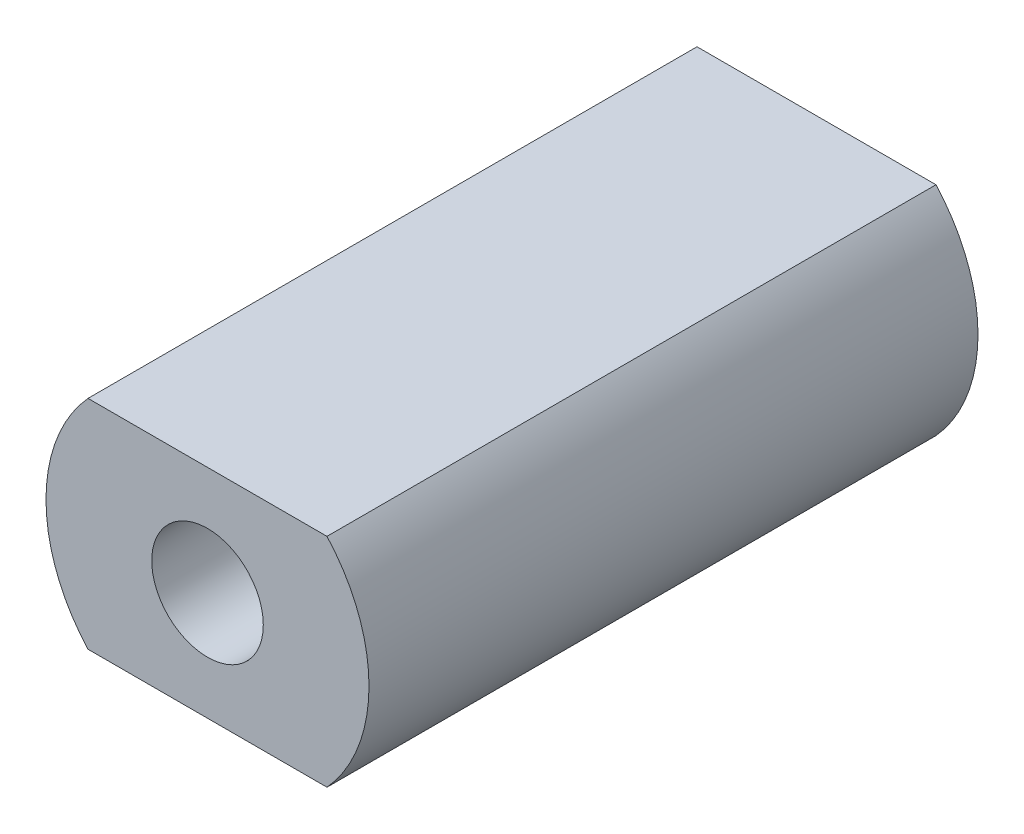
ISO-10303-21;
HEADER;
FILE_DESCRIPTION(('STEP AP214'),'2;1');
FILE_NAME('part.step','',(''),(''),'','','');
FILE_SCHEMA(('AUTOMOTIVE_DESIGN { 1 0 10303 214 1 1 1 1 }'));
ENDSEC;
DATA;
#1=APPLICATION_CONTEXT('core data for automotive mechanical design processes');
#2=APPLICATION_PROTOCOL_DEFINITION('international standard','automotive_design',2000,#1);
#3=PRODUCT_CONTEXT('',#1,'mechanical');
#4=PRODUCT('Part','Part','',(#3));
#5=PRODUCT_RELATED_PRODUCT_CATEGORY('part','',(#4));
#6=PRODUCT_DEFINITION_FORMATION('','',#4);
#7=PRODUCT_DEFINITION_CONTEXT('part definition',#1,'design');
#8=PRODUCT_DEFINITION('design','',#6,#7);
#9=PRODUCT_DEFINITION_SHAPE('','',#8);
#10=(LENGTH_UNIT() NAMED_UNIT(*) SI_UNIT(.MILLI.,.METRE.));
#11=(NAMED_UNIT(*) PLANE_ANGLE_UNIT() SI_UNIT($,.RADIAN.));
#12=(NAMED_UNIT(*) SI_UNIT($,.STERADIAN.) SOLID_ANGLE_UNIT());
#13=UNCERTAINTY_MEASURE_WITH_UNIT(LENGTH_MEASURE(1.E-05),#10,'distance_accuracy_value','');
#14=(GEOMETRIC_REPRESENTATION_CONTEXT(3) GLOBAL_UNCERTAINTY_ASSIGNED_CONTEXT((#13)) GLOBAL_UNIT_ASSIGNED_CONTEXT((#10,
#11,#12)) REPRESENTATION_CONTEXT('',''));
#15=CARTESIAN_POINT('',(0.,0.,0.));
#16=DIRECTION('',(0.,0.,1.));
#17=DIRECTION('',(1.,0.,0.));
#18=AXIS2_PLACEMENT_3D('',#15,#16,#17);
#19=CARTESIAN_POINT('',(0.,0.,10.370000088));
#20=DIRECTION('',(0.,0.,1.));
#21=DIRECTION('',(1.,0.,0.));
#22=AXIS2_PLACEMENT_3D('',#19,#20,#21);
#23=PLANE('',#22);
#24=CARTESIAN_POINT('',(0.,0.,10.370000088));
#25=DIRECTION('',(0.,0.,1.));
#26=DIRECTION('',(1.,0.,0.));
#27=AXIS2_PLACEMENT_3D('',#24,#25,#26);
#28=CIRCLE('',#27,2.75);
#29=CARTESIAN_POINT('',(-2.03469899493758,1.85,10.370000088));
#30=VERTEX_POINT('',#29);
#31=CARTESIAN_POINT('',(-2.03469899493758,-1.85,10.370000088));
#32=VERTEX_POINT('',#31);
#33=EDGE_CURVE('E86',#30,#32,#28,.T.);
#34=ORIENTED_EDGE('',*,*,#33,.T.);
#35=DIRECTION('',(1.,0.,0.));
#36=VECTOR('',#35,1.);
#37=CARTESIAN_POINT('',(-2.03469899493758,-1.85,10.370000088));
#38=LINE('',#37,#36);
#39=CARTESIAN_POINT('',(2.03469899493758,-1.85,10.370000088));
#40=VERTEX_POINT('',#39);
#41=EDGE_CURVE('E81',#32,#40,#38,.T.);
#42=ORIENTED_EDGE('',*,*,#41,.T.);
#43=CARTESIAN_POINT('',(0.,0.,10.370000088));
#44=DIRECTION('',(0.,0.,1.));
#45=DIRECTION('',(1.,0.,0.));
#46=AXIS2_PLACEMENT_3D('',#43,#44,#45);
#47=CIRCLE('',#46,2.75);
#48=CARTESIAN_POINT('',(2.03469899493758,1.85,10.370000088));
#49=VERTEX_POINT('',#48);
#50=EDGE_CURVE('E84',#40,#49,#47,.T.);
#51=ORIENTED_EDGE('',*,*,#50,.T.);
#52=DIRECTION('',(-1.,0.,0.));
#53=VECTOR('',#52,1.);
#54=CARTESIAN_POINT('',(-2.03469899493758,1.85,10.370000088));
#55=LINE('',#54,#53);
#56=EDGE_CURVE('E51',#49,#30,#55,.T.);
#57=ORIENTED_EDGE('',*,*,#56,.T.);
#58=EDGE_LOOP('',(#34,#42,#51,#57));
#59=FACE_BOUND('',#58,.T.);
#60=CARTESIAN_POINT('',(0.,0.,10.370000088));
#61=DIRECTION('',(0.,0.,1.));
#62=DIRECTION('',(1.,0.,0.));
#63=AXIS2_PLACEMENT_3D('',#60,#61,#62);
#64=CIRCLE('',#63,0.95);
#65=CARTESIAN_POINT('',(0.95,0.,10.370000088));
#66=VERTEX_POINT('',#65);
#67=EDGE_CURVE('E101',#66,#66,#64,.T.);
#68=ORIENTED_EDGE('',*,*,#67,.F.);
#69=EDGE_LOOP('',(#68));
#70=FACE_BOUND('',#69,.T.);
#71=ADVANCED_FACE('F34',(#59,#70),#23,.T.);
#72=CARTESIAN_POINT('',(0.,0.,0.));
#73=DIRECTION('',(0.,0.,1.));
#74=DIRECTION('',(1.,0.,0.));
#75=AXIS2_PLACEMENT_3D('',#72,#73,#74);
#76=PLANE('',#75);
#77=CARTESIAN_POINT('',(0.,0.,0.));
#78=DIRECTION('',(0.,0.,1.));
#79=DIRECTION('',(1.,0.,0.));
#80=AXIS2_PLACEMENT_3D('',#77,#78,#79);
#81=CIRCLE('',#80,2.75);
#82=CARTESIAN_POINT('',(-2.03469899493758,1.85,0.));
#83=VERTEX_POINT('',#82);
#84=CARTESIAN_POINT('',(-2.03469899493758,-1.85,0.));
#85=VERTEX_POINT('',#84);
#86=EDGE_CURVE('E98',#83,#85,#81,.T.);
#87=ORIENTED_EDGE('',*,*,#86,.F.);
#88=DIRECTION('',(-1.,0.,0.));
#89=VECTOR('',#88,1.);
#90=CARTESIAN_POINT('',(-2.03469899493758,1.85,0.));
#91=LINE('',#90,#89);
#92=CARTESIAN_POINT('',(2.03469899493758,1.85,0.));
#93=VERTEX_POINT('',#92);
#94=EDGE_CURVE('E74',#93,#83,#91,.T.);
#95=ORIENTED_EDGE('',*,*,#94,.F.);
#96=CARTESIAN_POINT('',(0.,0.,0.));
#97=DIRECTION('',(0.,0.,1.));
#98=DIRECTION('',(1.,0.,0.));
#99=AXIS2_PLACEMENT_3D('',#96,#97,#98);
#100=CIRCLE('',#99,2.75);
#101=CARTESIAN_POINT('',(2.03469899493758,-1.85,0.));
#102=VERTEX_POINT('',#101);
#103=EDGE_CURVE('E68',#102,#93,#100,.T.);
#104=ORIENTED_EDGE('',*,*,#103,.F.);
#105=DIRECTION('',(1.,0.,0.));
#106=VECTOR('',#105,1.);
#107=CARTESIAN_POINT('',(-2.03469899493758,-1.85,0.));
#108=LINE('',#107,#106);
#109=EDGE_CURVE('E90',#85,#102,#108,.T.);
#110=ORIENTED_EDGE('',*,*,#109,.F.);
#111=EDGE_LOOP('',(#87,#95,#104,#110));
#112=FACE_BOUND('',#111,.T.);
#113=CARTESIAN_POINT('',(0.,0.,0.));
#114=DIRECTION('',(0.,0.,1.));
#115=DIRECTION('',(1.,0.,0.));
#116=AXIS2_PLACEMENT_3D('',#113,#114,#115);
#117=CIRCLE('',#116,0.95);
#118=CARTESIAN_POINT('',(0.95,0.,0.));
#119=VERTEX_POINT('',#118);
#120=EDGE_CURVE('E113',#119,#119,#117,.T.);
#121=ORIENTED_EDGE('',*,*,#120,.T.);
#122=EDGE_LOOP('',(#121));
#123=FACE_BOUND('',#122,.T.);
#124=ADVANCED_FACE('F109',(#112,#123),#76,.F.);
#125=CARTESIAN_POINT('',(0.,0.,10.370000088));
#126=DIRECTION('',(0.,0.,-1.));
#127=DIRECTION('',(-1.,0.,0.));
#128=AXIS2_PLACEMENT_3D('',#125,#126,#127);
#129=CYLINDRICAL_SURFACE('',#128,2.75);
#130=ORIENTED_EDGE('',*,*,#86,.T.);
#131=DIRECTION('',(0.,0.,-1.));
#132=VECTOR('',#131,1.);
#133=CARTESIAN_POINT('',(-2.03469899493758,-1.85,10.370000088));
#134=LINE('',#133,#132);
#135=EDGE_CURVE('E11',#32,#85,#134,.T.);
#136=ORIENTED_EDGE('',*,*,#135,.F.);
#137=ORIENTED_EDGE('',*,*,#33,.F.);
#138=DIRECTION('',(0.,0.,-1.));
#139=VECTOR('',#138,1.);
#140=CARTESIAN_POINT('',(-2.03469899493758,1.85,10.370000088));
#141=LINE('',#140,#139);
#142=EDGE_CURVE('E94',#30,#83,#141,.T.);
#143=ORIENTED_EDGE('',*,*,#142,.T.);
#144=EDGE_LOOP('',(#130,#136,#137,#143));
#145=FACE_BOUND('',#144,.T.);
#146=ADVANCED_FACE('F36',(#145),#129,.T.);
#147=CARTESIAN_POINT('',(-2.03469899493758,-1.85,10.370000088));
#148=DIRECTION('',(0.,1.,0.));
#149=DIRECTION('',(0.,0.,1.));
#150=AXIS2_PLACEMENT_3D('',#147,#148,#149);
#151=PLANE('',#150);
#152=ORIENTED_EDGE('',*,*,#109,.T.);
#153=DIRECTION('',(0.,0.,-1.));
#154=VECTOR('',#153,1.);
#155=CARTESIAN_POINT('',(2.03469899493758,-1.85,10.370000088));
#156=LINE('',#155,#154);
#157=EDGE_CURVE('E43',#40,#102,#156,.T.);
#158=ORIENTED_EDGE('',*,*,#157,.F.);
#159=ORIENTED_EDGE('',*,*,#41,.F.);
#160=ORIENTED_EDGE('',*,*,#135,.T.);
#161=EDGE_LOOP('',(#152,#158,#159,#160));
#162=FACE_BOUND('',#161,.T.);
#163=ADVANCED_FACE('F89',(#162),#151,.F.);
#164=CARTESIAN_POINT('',(0.,0.,10.370000088));
#165=DIRECTION('',(0.,0.,-1.));
#166=DIRECTION('',(-1.,0.,0.));
#167=AXIS2_PLACEMENT_3D('',#164,#165,#166);
#168=CYLINDRICAL_SURFACE('',#167,2.75);
#169=ORIENTED_EDGE('',*,*,#103,.T.);
#170=DIRECTION('',(0.,0.,-1.));
#171=VECTOR('',#170,1.);
#172=CARTESIAN_POINT('',(2.03469899493758,1.85,10.370000088));
#173=LINE('',#172,#171);
#174=EDGE_CURVE('E91',#49,#93,#173,.T.);
#175=ORIENTED_EDGE('',*,*,#174,.F.);
#176=ORIENTED_EDGE('',*,*,#50,.F.);
#177=ORIENTED_EDGE('',*,*,#157,.T.);
#178=EDGE_LOOP('',(#169,#175,#176,#177));
#179=FACE_BOUND('',#178,.T.);
#180=ADVANCED_FACE('F92',(#179),#168,.T.);
#181=CARTESIAN_POINT('',(-2.03469899493758,1.85,10.370000088));
#182=DIRECTION('',(0.,-1.,0.));
#183=DIRECTION('',(0.,0.,-1.));
#184=AXIS2_PLACEMENT_3D('',#181,#182,#183);
#185=PLANE('',#184);
#186=ORIENTED_EDGE('',*,*,#94,.T.);
#187=ORIENTED_EDGE('',*,*,#142,.F.);
#188=ORIENTED_EDGE('',*,*,#56,.F.);
#189=ORIENTED_EDGE('',*,*,#174,.T.);
#190=EDGE_LOOP('',(#186,#187,#188,#189));
#191=FACE_BOUND('',#190,.T.);
#192=ADVANCED_FACE('F106',(#191),#185,.F.);
#193=CARTESIAN_POINT('',(0.,0.,10.370000088));
#194=DIRECTION('',(0.,0.,-1.));
#195=DIRECTION('',(-1.,0.,0.));
#196=AXIS2_PLACEMENT_3D('',#193,#194,#195);
#197=CYLINDRICAL_SURFACE('',#196,0.95);
#198=ORIENTED_EDGE('',*,*,#67,.T.);
#199=EDGE_LOOP('',(#198));
#200=FACE_BOUND('',#199,.T.);
#201=ORIENTED_EDGE('',*,*,#120,.F.);
#202=EDGE_LOOP('',(#201));
#203=FACE_BOUND('',#202,.T.);
#204=ADVANCED_FACE('F119',(#200,#203),#197,.F.);
#205=CLOSED_SHELL('',(#71,#124,#146,#163,#180,#192,#204));
#206=MANIFOLD_SOLID_BREP('B2',#205);
#207=ADVANCED_BREP_SHAPE_REPRESENTATION('',(#18,#206),#14);
#208=SHAPE_DEFINITION_REPRESENTATION(#9,#207);
ENDSEC;
END-ISO-10303-21;
